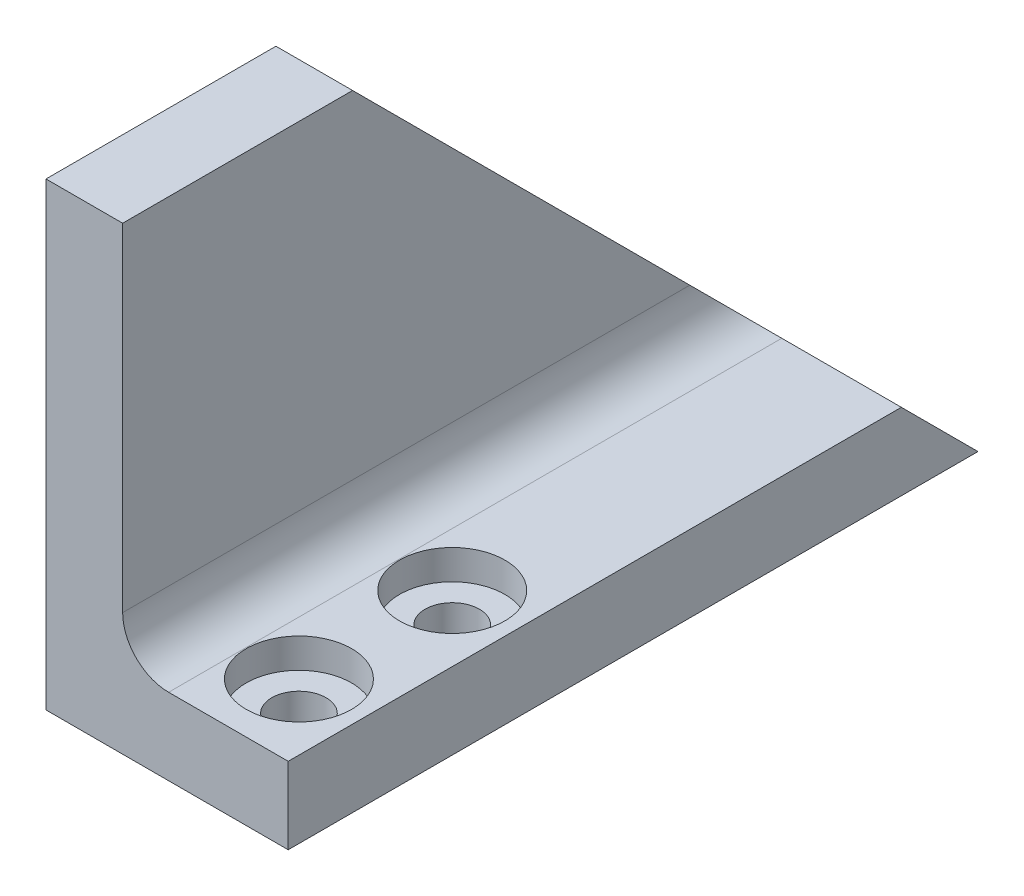
ISO-10303-21;
HEADER;
FILE_DESCRIPTION(('STEP AP214'),'2;1');
FILE_NAME('part.step','',(''),(''),'','','');
FILE_SCHEMA(('AUTOMOTIVE_DESIGN { 1 0 10303 214 1 1 1 1 }'));
ENDSEC;
DATA;
#1=APPLICATION_CONTEXT('core data for automotive mechanical design processes');
#2=APPLICATION_PROTOCOL_DEFINITION('international standard','automotive_design',2000,#1);
#3=PRODUCT_CONTEXT('',#1,'mechanical');
#4=PRODUCT('Part','Part','',(#3));
#5=PRODUCT_RELATED_PRODUCT_CATEGORY('part','',(#4));
#6=PRODUCT_DEFINITION_FORMATION('','',#4);
#7=PRODUCT_DEFINITION_CONTEXT('part definition',#1,'design');
#8=PRODUCT_DEFINITION('design','',#6,#7);
#9=PRODUCT_DEFINITION_SHAPE('','',#8);
#10=(LENGTH_UNIT() NAMED_UNIT(*) SI_UNIT(.MILLI.,.METRE.));
#11=(NAMED_UNIT(*) PLANE_ANGLE_UNIT() SI_UNIT($,.RADIAN.));
#12=(NAMED_UNIT(*) SI_UNIT($,.STERADIAN.) SOLID_ANGLE_UNIT());
#13=UNCERTAINTY_MEASURE_WITH_UNIT(LENGTH_MEASURE(1.E-05),#10,'distance_accuracy_value','');
#14=(GEOMETRIC_REPRESENTATION_CONTEXT(3) GLOBAL_UNCERTAINTY_ASSIGNED_CONTEXT((#13)) GLOBAL_UNIT_ASSIGNED_CONTEXT((#10,
#11,#12)) REPRESENTATION_CONTEXT('',''));
#15=CARTESIAN_POINT('',(0.,0.,0.));
#16=DIRECTION('',(0.,0.,1.));
#17=DIRECTION('',(1.,0.,0.));
#18=AXIS2_PLACEMENT_3D('',#15,#16,#17);
#19=CARTESIAN_POINT('',(-9.525,38.1,28.575));
#20=DIRECTION('',(1.,0.,0.));
#21=DIRECTION('',(0.,0.,-1.));
#22=AXIS2_PLACEMENT_3D('',#19,#20,#21);
#23=PLANE('',#22);
#24=DIRECTION('',(0.,0.,1.));
#25=VECTOR('',#24,1.);
#26=CARTESIAN_POINT('',(-9.525,38.1,28.575));
#27=LINE('',#26,#25);
#28=CARTESIAN_POINT('',(-9.525,38.1,9.52500000000041));
#29=VERTEX_POINT('',#28);
#30=CARTESIAN_POINT('',(-9.525,38.1,28.575));
#31=VERTEX_POINT('',#30);
#32=EDGE_CURVE('E156',#29,#31,#27,.T.);
#33=ORIENTED_EDGE('',*,*,#32,.F.);
#34=DIRECTION('',(0.,-0.707106781186544,-0.707106781186551));
#35=VECTOR('',#34,1.);
#36=CARTESIAN_POINT('',(-9.525,0.,-28.575));
#37=LINE('',#36,#35);
#38=CARTESIAN_POINT('',(-9.525,0.,-28.575));
#39=VERTEX_POINT('',#38);
#40=EDGE_CURVE('E153',#29,#39,#37,.T.);
#41=ORIENTED_EDGE('',*,*,#40,.T.);
#42=DIRECTION('',(0.,0.,1.));
#43=VECTOR('',#42,1.);
#44=CARTESIAN_POINT('',(-9.525,0.,28.575));
#45=LINE('',#44,#43);
#46=CARTESIAN_POINT('',(-9.525,0.,28.575));
#47=VERTEX_POINT('',#46);
#48=EDGE_CURVE('E98',#39,#47,#45,.T.);
#49=ORIENTED_EDGE('',*,*,#48,.T.);
#50=DIRECTION('',(0.,-1.,0.));
#51=VECTOR('',#50,1.);
#52=CARTESIAN_POINT('',(-9.525,38.1,28.575));
#53=LINE('',#52,#51);
#54=EDGE_CURVE('E161',#31,#47,#53,.T.);
#55=ORIENTED_EDGE('',*,*,#54,.F.);
#56=EDGE_LOOP('',(#33,#41,#49,#55));
#57=FACE_BOUND('',#56,.T.);
#58=ADVANCED_FACE('F34',(#57),#23,.F.);
#59=CARTESIAN_POINT('',(-9.525,38.1,28.575));
#60=DIRECTION('',(0.,0.,-1.));
#61=DIRECTION('',(-1.,0.,0.));
#62=AXIS2_PLACEMENT_3D('',#59,#60,#61);
#63=PLANE('',#62);
#64=DIRECTION('',(1.,0.,0.));
#65=VECTOR('',#64,1.);
#66=CARTESIAN_POINT('',(22.225,6.35,28.575));
#67=LINE('',#66,#65);
#68=CARTESIAN_POINT('',(0.635,6.35,28.575));
#69=VERTEX_POINT('',#68);
#70=CARTESIAN_POINT('',(10.541,6.35,28.575));
#71=VERTEX_POINT('',#70);
#72=EDGE_CURVE('E148',#69,#71,#67,.T.);
#73=ORIENTED_EDGE('',*,*,#72,.F.);
#74=CARTESIAN_POINT('',(0.635,10.16,28.575));
#75=DIRECTION('',(0.,0.,-1.));
#76=DIRECTION('',(-1.,0.,0.));
#77=AXIS2_PLACEMENT_3D('',#74,#75,#76);
#78=CIRCLE('',#77,3.81);
#79=CARTESIAN_POINT('',(-3.175,10.16,28.575));
#80=VERTEX_POINT('',#79);
#81=EDGE_CURVE('E42',#69,#80,#78,.T.);
#82=ORIENTED_EDGE('',*,*,#81,.T.);
#83=DIRECTION('',(0.,-1.,0.));
#84=VECTOR('',#83,1.);
#85=CARTESIAN_POINT('',(-3.175,69.85,28.575));
#86=LINE('',#85,#84);
#87=CARTESIAN_POINT('',(-3.175,38.1,28.575));
#88=VERTEX_POINT('',#87);
#89=EDGE_CURVE('E146',#88,#80,#86,.T.);
#90=ORIENTED_EDGE('',*,*,#89,.F.);
#91=DIRECTION('',(1.,0.,0.));
#92=VECTOR('',#91,1.);
#93=CARTESIAN_POINT('',(-9.525,38.1,28.575));
#94=LINE('',#93,#92);
#95=EDGE_CURVE('E158',#31,#88,#94,.T.);
#96=ORIENTED_EDGE('',*,*,#95,.F.);
#97=ORIENTED_EDGE('',*,*,#54,.T.);
#98=DIRECTION('',(1.,0.,0.));
#99=VECTOR('',#98,1.);
#100=CARTESIAN_POINT('',(-9.525,0.,28.575));
#101=LINE('',#100,#99);
#102=CARTESIAN_POINT('',(10.541,0.,28.575));
#103=VERTEX_POINT('',#102);
#104=EDGE_CURVE('E159',#47,#103,#101,.T.);
#105=ORIENTED_EDGE('',*,*,#104,.T.);
#106=DIRECTION('',(0.,-1.,0.));
#107=VECTOR('',#106,1.);
#108=CARTESIAN_POINT('',(10.541,6.35,28.575));
#109=LINE('',#108,#107);
#110=EDGE_CURVE('E117',#71,#103,#109,.T.);
#111=ORIENTED_EDGE('',*,*,#110,.F.);
#112=EDGE_LOOP('',(#73,#82,#90,#96,#97,#105,#111));
#113=FACE_BOUND('',#112,.T.);
#114=ADVANCED_FACE('F178',(#113),#63,.F.);
#115=CARTESIAN_POINT('',(0.,38.1,0.));
#116=DIRECTION('',(0.,-1.,0.));
#117=DIRECTION('',(0.,0.,-1.));
#118=AXIS2_PLACEMENT_3D('',#115,#116,#117);
#119=PLANE('',#118);
#120=ORIENTED_EDGE('',*,*,#95,.T.);
#121=DIRECTION('',(0.,0.,-1.));
#122=VECTOR('',#121,1.);
#123=CARTESIAN_POINT('',(-3.175,38.1,0.));
#124=LINE('',#123,#122);
#125=CARTESIAN_POINT('',(-3.175,38.1,9.52500000000041));
#126=VERTEX_POINT('',#125);
#127=EDGE_CURVE('E150',#88,#126,#124,.T.);
#128=ORIENTED_EDGE('',*,*,#127,.T.);
#129=DIRECTION('',(1.,0.,0.));
#130=VECTOR('',#129,1.);
#131=CARTESIAN_POINT('',(-9.525,38.1,9.52500000000041));
#132=LINE('',#131,#130);
#133=EDGE_CURVE('E101',#29,#126,#132,.T.);
#134=ORIENTED_EDGE('',*,*,#133,.F.);
#135=ORIENTED_EDGE('',*,*,#32,.T.);
#136=EDGE_LOOP('',(#120,#128,#134,#135));
#137=FACE_BOUND('',#136,.T.);
#138=ADVANCED_FACE('F185',(#137),#119,.F.);
#139=CARTESIAN_POINT('',(0.,0.,0.));
#140=DIRECTION('',(0.,-1.,0.));
#141=DIRECTION('',(0.,0.,-1.));
#142=AXIS2_PLACEMENT_3D('',#139,#140,#141);
#143=PLANE('',#142);
#144=CARTESIAN_POINT('',(5.08,0.,22.225));
#145=DIRECTION('',(0.,1.,0.));
#146=DIRECTION('',(0.,0.,1.));
#147=AXIS2_PLACEMENT_3D('',#144,#145,#146);
#148=CIRCLE('',#147,2.2479);
#149=CARTESIAN_POINT('',(5.08,0.,24.4729));
#150=VERTEX_POINT('',#149);
#151=EDGE_CURVE('E131',#150,#150,#148,.T.);
#152=ORIENTED_EDGE('',*,*,#151,.T.);
#153=EDGE_LOOP('',(#152));
#154=FACE_BOUND('',#153,.T.);
#155=CARTESIAN_POINT('',(5.08,0.,9.525));
#156=DIRECTION('',(0.,1.,0.));
#157=DIRECTION('',(0.,0.,1.));
#158=AXIS2_PLACEMENT_3D('',#155,#156,#157);
#159=CIRCLE('',#158,2.2479);
#160=CARTESIAN_POINT('',(5.08,0.,11.7729));
#161=VERTEX_POINT('',#160);
#162=EDGE_CURVE('E143',#161,#161,#159,.T.);
#163=ORIENTED_EDGE('',*,*,#162,.T.);
#164=EDGE_LOOP('',(#163));
#165=FACE_BOUND('',#164,.T.);
#166=DIRECTION('',(-1.,0.,0.));
#167=VECTOR('',#166,1.);
#168=CARTESIAN_POINT('',(-9.525,0.,-28.575));
#169=LINE('',#168,#167);
#170=CARTESIAN_POINT('',(10.541,0.,-28.575));
#171=VERTEX_POINT('',#170);
#172=EDGE_CURVE('E92',#171,#39,#169,.T.);
#173=ORIENTED_EDGE('',*,*,#172,.F.);
#174=DIRECTION('',(0.,0.,-1.));
#175=VECTOR('',#174,1.);
#176=CARTESIAN_POINT('',(10.541,0.,28.575));
#177=LINE('',#176,#175);
#178=EDGE_CURVE('E97',#103,#171,#177,.T.);
#179=ORIENTED_EDGE('',*,*,#178,.F.);
#180=ORIENTED_EDGE('',*,*,#104,.F.);
#181=ORIENTED_EDGE('',*,*,#48,.F.);
#182=EDGE_LOOP('',(#173,#179,#180,#181));
#183=FACE_BOUND('',#182,.T.);
#184=ADVANCED_FACE('F94',(#154,#165,#183),#143,.T.);
#185=CARTESIAN_POINT('',(-9.525,0.,-28.575));
#186=DIRECTION('',(0.,-0.707106781186551,0.707106781186544));
#187=DIRECTION('',(0.,-0.707106781186544,-0.707106781186551));
#188=AXIS2_PLACEMENT_3D('',#185,#186,#187);
#189=PLANE('',#188);
#190=ORIENTED_EDGE('',*,*,#133,.T.);
#191=DIRECTION('',(0.,-0.707106781186544,-0.707106781186551));
#192=VECTOR('',#191,1.);
#193=CARTESIAN_POINT('',(-3.175,0.,-28.575));
#194=LINE('',#193,#192);
#195=CARTESIAN_POINT('',(-3.175,10.16,-18.4149999999999));
#196=VERTEX_POINT('',#195);
#197=EDGE_CURVE('E168',#126,#196,#194,.T.);
#198=ORIENTED_EDGE('',*,*,#197,.T.);
#199=CARTESIAN_POINT('',(0.635,10.16,-18.4149999999999));
#200=DIRECTION('',(0.,-0.707106781186551,0.707106781186544));
#201=DIRECTION('',(0.,-0.707106781186544,-0.707106781186551));
#202=AXIS2_PLACEMENT_3D('',#199,#200,#201);
#203=ELLIPSE('',#202,5.38815367264152,3.81);
#204=CARTESIAN_POINT('',(0.635,6.35,-22.2249999999999));
#205=VERTEX_POINT('',#204);
#206=EDGE_CURVE('E11',#196,#205,#203,.T.);
#207=ORIENTED_EDGE('',*,*,#206,.T.);
#208=DIRECTION('',(1.,0.,0.));
#209=VECTOR('',#208,1.);
#210=CARTESIAN_POINT('',(-9.525,6.35,-22.2249999999999));
#211=LINE('',#210,#209);
#212=CARTESIAN_POINT('',(10.541,6.35,-22.2249999999999));
#213=VERTEX_POINT('',#212);
#214=EDGE_CURVE('E108',#205,#213,#211,.T.);
#215=ORIENTED_EDGE('',*,*,#214,.T.);
#216=DIRECTION('',(0.,0.707106781186544,0.707106781186552));
#217=VECTOR('',#216,1.);
#218=CARTESIAN_POINT('',(10.541,0.,-28.575));
#219=LINE('',#218,#217);
#220=EDGE_CURVE('E104',#171,#213,#219,.T.);
#221=ORIENTED_EDGE('',*,*,#220,.F.);
#222=ORIENTED_EDGE('',*,*,#172,.T.);
#223=ORIENTED_EDGE('',*,*,#40,.F.);
#224=EDGE_LOOP('',(#190,#198,#207,#215,#221,#222,#223));
#225=FACE_BOUND('',#224,.T.);
#226=ADVANCED_FACE('F106',(#225),#189,.F.);
#227=CARTESIAN_POINT('',(-3.175,69.85,-34.925));
#228=DIRECTION('',(-1.,0.,0.));
#229=DIRECTION('',(0.,0.,1.));
#230=AXIS2_PLACEMENT_3D('',#227,#228,#229);
#231=PLANE('',#230);
#232=ORIENTED_EDGE('',*,*,#89,.T.);
#233=DIRECTION('',(0.,0.,1.));
#234=VECTOR('',#233,1.);
#235=CARTESIAN_POINT('',(-3.175,10.16,-22.2249999999999));
#236=LINE('',#235,#234);
#237=EDGE_CURVE('E49',#80,#196,#236,.F.);
#238=ORIENTED_EDGE('',*,*,#237,.T.);
#239=ORIENTED_EDGE('',*,*,#197,.F.);
#240=ORIENTED_EDGE('',*,*,#127,.F.);
#241=EDGE_LOOP('',(#232,#238,#239,#240));
#242=FACE_BOUND('',#241,.T.);
#243=ADVANCED_FACE('F186',(#242),#231,.F.);
#244=CARTESIAN_POINT('',(22.225,6.35,-34.925));
#245=DIRECTION('',(0.,-1.,0.));
#246=DIRECTION('',(0.,0.,-1.));
#247=AXIS2_PLACEMENT_3D('',#244,#245,#246);
#248=PLANE('',#247);
#249=CARTESIAN_POINT('',(5.08,6.35,22.225));
#250=DIRECTION('',(0.,1.,0.));
#251=DIRECTION('',(0.,0.,1.));
#252=AXIS2_PLACEMENT_3D('',#249,#250,#251);
#253=CIRCLE('',#252,4.36625999999999);
#254=CARTESIAN_POINT('',(5.08,6.35,26.59126));
#255=VERTEX_POINT('',#254);
#256=EDGE_CURVE('E122',#255,#255,#253,.T.);
#257=ORIENTED_EDGE('',*,*,#256,.F.);
#258=EDGE_LOOP('',(#257));
#259=FACE_BOUND('',#258,.T.);
#260=CARTESIAN_POINT('',(5.08,6.35,9.525));
#261=DIRECTION('',(0.,1.,0.));
#262=DIRECTION('',(0.,0.,1.));
#263=AXIS2_PLACEMENT_3D('',#260,#261,#262);
#264=CIRCLE('',#263,4.36625999999999);
#265=CARTESIAN_POINT('',(5.08,6.35,13.89126));
#266=VERTEX_POINT('',#265);
#267=EDGE_CURVE('E134',#266,#266,#264,.T.);
#268=ORIENTED_EDGE('',*,*,#267,.F.);
#269=EDGE_LOOP('',(#268));
#270=FACE_BOUND('',#269,.T.);
#271=ORIENTED_EDGE('',*,*,#214,.F.);
#272=DIRECTION('',(0.,0.,1.));
#273=VECTOR('',#272,1.);
#274=CARTESIAN_POINT('',(0.635,6.35,28.575));
#275=LINE('',#274,#273);
#276=EDGE_CURVE('E170',#205,#69,#275,.T.);
#277=ORIENTED_EDGE('',*,*,#276,.T.);
#278=ORIENTED_EDGE('',*,*,#72,.T.);
#279=DIRECTION('',(0.,0.,1.));
#280=VECTOR('',#279,1.);
#281=CARTESIAN_POINT('',(10.541,6.35,-22.2249999999999));
#282=LINE('',#281,#280);
#283=EDGE_CURVE('E112',#213,#71,#282,.T.);
#284=ORIENTED_EDGE('',*,*,#283,.F.);
#285=EDGE_LOOP('',(#271,#277,#278,#284));
#286=FACE_BOUND('',#285,.T.);
#287=ADVANCED_FACE('F175',(#259,#270,#286),#248,.F.);
#288=CARTESIAN_POINT('',(0.635,10.16,-34.925));
#289=DIRECTION('',(0.,0.,-1.));
#290=DIRECTION('',(-1.,0.,0.));
#291=AXIS2_PLACEMENT_3D('',#288,#289,#290);
#292=CYLINDRICAL_SURFACE('',#291,3.81);
#293=ORIENTED_EDGE('',*,*,#206,.F.);
#294=ORIENTED_EDGE('',*,*,#237,.F.);
#295=ORIENTED_EDGE('',*,*,#81,.F.);
#296=ORIENTED_EDGE('',*,*,#276,.F.);
#297=EDGE_LOOP('',(#293,#294,#295,#296));
#298=FACE_BOUND('',#297,.T.);
#299=ADVANCED_FACE('F36',(#298),#292,.F.);
#300=CARTESIAN_POINT('',(5.08,6.35,9.525));
#301=DIRECTION('',(0.,1.,0.));
#302=DIRECTION('',(0.,0.,1.));
#303=AXIS2_PLACEMENT_3D('',#300,#301,#302);
#304=CYLINDRICAL_SURFACE('',#303,2.2479);
#305=ORIENTED_EDGE('',*,*,#162,.F.);
#306=EDGE_LOOP('',(#305));
#307=FACE_BOUND('',#306,.T.);
#308=CARTESIAN_POINT('',(5.08,3.8862,9.525));
#309=DIRECTION('',(0.,1.,0.));
#310=DIRECTION('',(0.,0.,1.));
#311=AXIS2_PLACEMENT_3D('',#308,#309,#310);
#312=CIRCLE('',#311,2.2479);
#313=CARTESIAN_POINT('',(5.08,3.8862,11.7729));
#314=VERTEX_POINT('',#313);
#315=EDGE_CURVE('E140',#314,#314,#312,.T.);
#316=ORIENTED_EDGE('',*,*,#315,.T.);
#317=EDGE_LOOP('',(#316));
#318=FACE_BOUND('',#317,.T.);
#319=ADVANCED_FACE('F188',(#307,#318),#304,.F.);
#320=CARTESIAN_POINT('',(7.3279,3.8862,9.525));
#321=DIRECTION('',(0.,-1.,0.));
#322=DIRECTION('',(0.,0.,-1.));
#323=AXIS2_PLACEMENT_3D('',#320,#321,#322);
#324=PLANE('',#323);
#325=ORIENTED_EDGE('',*,*,#315,.F.);
#326=EDGE_LOOP('',(#325));
#327=FACE_BOUND('',#326,.T.);
#328=CARTESIAN_POINT('',(5.08,3.8862,9.525));
#329=DIRECTION('',(0.,1.,0.));
#330=DIRECTION('',(0.,0.,1.));
#331=AXIS2_PLACEMENT_3D('',#328,#329,#330);
#332=CIRCLE('',#331,4.36626);
#333=CARTESIAN_POINT('',(5.08,3.8862,13.89126));
#334=VERTEX_POINT('',#333);
#335=EDGE_CURVE('E137',#334,#334,#332,.T.);
#336=ORIENTED_EDGE('',*,*,#335,.T.);
#337=EDGE_LOOP('',(#336));
#338=FACE_BOUND('',#337,.T.);
#339=ADVANCED_FACE('F193',(#327,#338),#324,.F.);
#340=CARTESIAN_POINT('',(5.08,6.35,9.525));
#341=DIRECTION('',(0.,1.,0.));
#342=DIRECTION('',(0.,0.,1.));
#343=AXIS2_PLACEMENT_3D('',#340,#341,#342);
#344=CYLINDRICAL_SURFACE('',#343,4.36626);
#345=ORIENTED_EDGE('',*,*,#335,.F.);
#346=EDGE_LOOP('',(#345));
#347=FACE_BOUND('',#346,.T.);
#348=ORIENTED_EDGE('',*,*,#267,.T.);
#349=EDGE_LOOP('',(#348));
#350=FACE_BOUND('',#349,.T.);
#351=ADVANCED_FACE('F215',(#347,#350),#344,.F.);
#352=CARTESIAN_POINT('',(5.08,6.35,22.225));
#353=DIRECTION('',(0.,1.,0.));
#354=DIRECTION('',(0.,0.,1.));
#355=AXIS2_PLACEMENT_3D('',#352,#353,#354);
#356=CYLINDRICAL_SURFACE('',#355,2.2479);
#357=ORIENTED_EDGE('',*,*,#151,.F.);
#358=EDGE_LOOP('',(#357));
#359=FACE_BOUND('',#358,.T.);
#360=CARTESIAN_POINT('',(5.08,3.8862,22.225));
#361=DIRECTION('',(0.,1.,0.));
#362=DIRECTION('',(0.,0.,1.));
#363=AXIS2_PLACEMENT_3D('',#360,#361,#362);
#364=CIRCLE('',#363,2.2479);
#365=CARTESIAN_POINT('',(5.08,3.8862,24.4729));
#366=VERTEX_POINT('',#365);
#367=EDGE_CURVE('E128',#366,#366,#364,.T.);
#368=ORIENTED_EDGE('',*,*,#367,.T.);
#369=EDGE_LOOP('',(#368));
#370=FACE_BOUND('',#369,.T.);
#371=ADVANCED_FACE('F219',(#359,#370),#356,.F.);
#372=CARTESIAN_POINT('',(7.3279,3.8862,22.225));
#373=DIRECTION('',(0.,-1.,0.));
#374=DIRECTION('',(0.,0.,-1.));
#375=AXIS2_PLACEMENT_3D('',#372,#373,#374);
#376=PLANE('',#375);
#377=ORIENTED_EDGE('',*,*,#367,.F.);
#378=EDGE_LOOP('',(#377));
#379=FACE_BOUND('',#378,.T.);
#380=CARTESIAN_POINT('',(5.08,3.8862,22.225));
#381=DIRECTION('',(0.,1.,0.));
#382=DIRECTION('',(0.,0.,1.));
#383=AXIS2_PLACEMENT_3D('',#380,#381,#382);
#384=CIRCLE('',#383,4.36626);
#385=CARTESIAN_POINT('',(5.08,3.8862,26.59126));
#386=VERTEX_POINT('',#385);
#387=EDGE_CURVE('E125',#386,#386,#384,.T.);
#388=ORIENTED_EDGE('',*,*,#387,.T.);
#389=EDGE_LOOP('',(#388));
#390=FACE_BOUND('',#389,.T.);
#391=ADVANCED_FACE('F223',(#379,#390),#376,.F.);
#392=CARTESIAN_POINT('',(5.08,6.35,22.225));
#393=DIRECTION('',(0.,1.,0.));
#394=DIRECTION('',(0.,0.,1.));
#395=AXIS2_PLACEMENT_3D('',#392,#393,#394);
#396=CYLINDRICAL_SURFACE('',#395,4.36626);
#397=ORIENTED_EDGE('',*,*,#387,.F.);
#398=EDGE_LOOP('',(#397));
#399=FACE_BOUND('',#398,.T.);
#400=ORIENTED_EDGE('',*,*,#256,.T.);
#401=EDGE_LOOP('',(#400));
#402=FACE_BOUND('',#401,.T.);
#403=ADVANCED_FACE('F227',(#399,#402),#396,.F.);
#404=CARTESIAN_POINT('',(10.541,0.,0.));
#405=DIRECTION('',(-1.,0.,0.));
#406=DIRECTION('',(0.,0.,1.));
#407=AXIS2_PLACEMENT_3D('',#404,#405,#406);
#408=PLANE('',#407);
#409=ORIENTED_EDGE('',*,*,#178,.T.);
#410=ORIENTED_EDGE('',*,*,#220,.T.);
#411=ORIENTED_EDGE('',*,*,#283,.T.);
#412=ORIENTED_EDGE('',*,*,#110,.T.);
#413=EDGE_LOOP('',(#409,#410,#411,#412));
#414=FACE_BOUND('',#413,.T.);
#415=ADVANCED_FACE('F115',(#414),#408,.F.);
#416=CLOSED_SHELL('',(#58,#114,#138,#184,#226,#243,#287,#299,#319,#339,#351,#371,#391,#403,#415));
#417=MANIFOLD_SOLID_BREP('B2',#416);
#418=ADVANCED_BREP_SHAPE_REPRESENTATION('',(#18,#417),#14);
#419=SHAPE_DEFINITION_REPRESENTATION(#9,#418);
ENDSEC;
END-ISO-10303-21;
